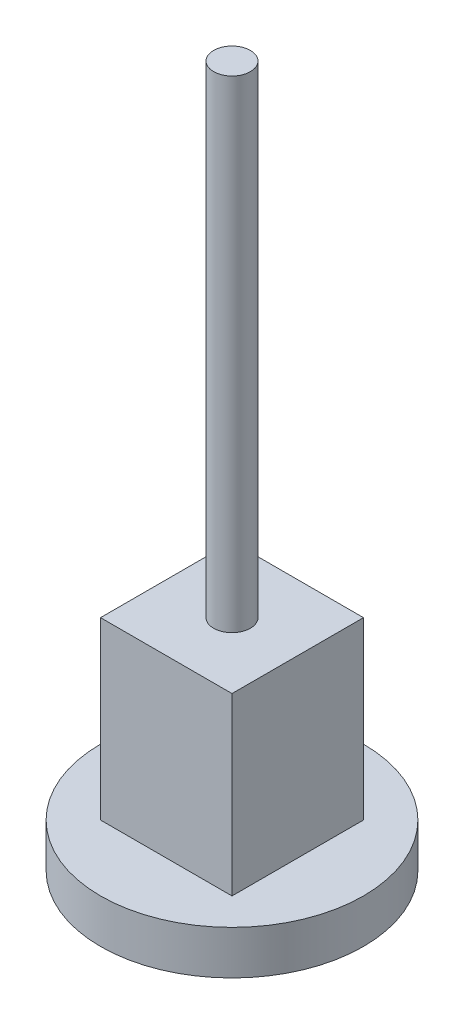
ISO-10303-21;
HEADER;
FILE_DESCRIPTION(('STEP AP214'),'2;1');
FILE_NAME('part.step','',(''),(''),'','','');
FILE_SCHEMA(('AUTOMOTIVE_DESIGN { 1 0 10303 214 1 1 1 1 }'));
ENDSEC;
DATA;
#1=APPLICATION_CONTEXT('core data for automotive mechanical design processes');
#2=APPLICATION_PROTOCOL_DEFINITION('international standard','automotive_design',2000,#1);
#3=PRODUCT_CONTEXT('',#1,'mechanical');
#4=PRODUCT('Part','Part','',(#3));
#5=PRODUCT_RELATED_PRODUCT_CATEGORY('part','',(#4));
#6=PRODUCT_DEFINITION_FORMATION('','',#4);
#7=PRODUCT_DEFINITION_CONTEXT('part definition',#1,'design');
#8=PRODUCT_DEFINITION('design','',#6,#7);
#9=PRODUCT_DEFINITION_SHAPE('','',#8);
#10=(LENGTH_UNIT() NAMED_UNIT(*) SI_UNIT(.MILLI.,.METRE.));
#11=(NAMED_UNIT(*) PLANE_ANGLE_UNIT() SI_UNIT($,.RADIAN.));
#12=(NAMED_UNIT(*) SI_UNIT($,.STERADIAN.) SOLID_ANGLE_UNIT());
#13=UNCERTAINTY_MEASURE_WITH_UNIT(LENGTH_MEASURE(1.E-05),#10,'distance_accuracy_value','');
#14=(GEOMETRIC_REPRESENTATION_CONTEXT(3) GLOBAL_UNCERTAINTY_ASSIGNED_CONTEXT((#13)) GLOBAL_UNIT_ASSIGNED_CONTEXT((#10,
#11,#12)) REPRESENTATION_CONTEXT('',''));
#15=CARTESIAN_POINT('',(0.,0.,0.));
#16=DIRECTION('',(0.,0.,1.));
#17=DIRECTION('',(1.,0.,0.));
#18=AXIS2_PLACEMENT_3D('',#15,#16,#17);
#19=CARTESIAN_POINT('',(0.,10.,0.));
#20=DIRECTION('',(0.,1.,0.));
#21=DIRECTION('',(0.,0.,1.));
#22=AXIS2_PLACEMENT_3D('',#19,#20,#21);
#23=PLANE('',#22);
#24=CARTESIAN_POINT('',(0.,10.,0.));
#25=DIRECTION('',(0.,1.,0.));
#26=DIRECTION('',(0.,0.,1.));
#27=AXIS2_PLACEMENT_3D('',#24,#25,#26);
#28=CIRCLE('',#27,30.);
#29=CARTESIAN_POINT('',(0.,10.,30.));
#30=VERTEX_POINT('',#29);
#31=EDGE_CURVE('E11',#30,#30,#28,.T.);
#32=ORIENTED_EDGE('',*,*,#31,.T.);
#33=EDGE_LOOP('',(#32));
#34=FACE_BOUND('',#33,.T.);
#35=DIRECTION('',(-1.,0.,0.));
#36=VECTOR('',#35,1.);
#37=CARTESIAN_POINT('',(-15.,10.,-15.));
#38=LINE('',#37,#36);
#39=CARTESIAN_POINT('',(15.,10.,-15.));
#40=VERTEX_POINT('',#39);
#41=CARTESIAN_POINT('',(-15.,10.,-15.));
#42=VERTEX_POINT('',#41);
#43=EDGE_CURVE('E89',#40,#42,#38,.T.);
#44=ORIENTED_EDGE('',*,*,#43,.F.);
#45=DIRECTION('',(0.,0.,-1.));
#46=VECTOR('',#45,1.);
#47=CARTESIAN_POINT('',(15.,10.,-15.));
#48=LINE('',#47,#46);
#49=CARTESIAN_POINT('',(15.,10.,15.));
#50=VERTEX_POINT('',#49);
#51=EDGE_CURVE('E100',#50,#40,#48,.T.);
#52=ORIENTED_EDGE('',*,*,#51,.F.);
#53=DIRECTION('',(1.,0.,0.));
#54=VECTOR('',#53,1.);
#55=CARTESIAN_POINT('',(-15.,10.,15.));
#56=LINE('',#55,#54);
#57=CARTESIAN_POINT('',(-15.,10.,15.));
#58=VERTEX_POINT('',#57);
#59=EDGE_CURVE('E70',#58,#50,#56,.T.);
#60=ORIENTED_EDGE('',*,*,#59,.F.);
#61=DIRECTION('',(0.,0.,1.));
#62=VECTOR('',#61,1.);
#63=CARTESIAN_POINT('',(-15.,10.,-15.));
#64=LINE('',#63,#62);
#65=EDGE_CURVE('E105',#42,#58,#64,.T.);
#66=ORIENTED_EDGE('',*,*,#65,.F.);
#67=EDGE_LOOP('',(#44,#52,#60,#66));
#68=FACE_BOUND('',#67,.T.);
#69=ADVANCED_FACE('F33',(#34,#68),#23,.T.);
#70=CARTESIAN_POINT('',(0.,10.,0.));
#71=DIRECTION('',(0.,-1.,0.));
#72=DIRECTION('',(0.,0.,-1.));
#73=AXIS2_PLACEMENT_3D('',#70,#71,#72);
#74=CYLINDRICAL_SURFACE('',#73,30.);
#75=ORIENTED_EDGE('',*,*,#31,.F.);
#76=EDGE_LOOP('',(#75));
#77=FACE_BOUND('',#76,.T.);
#78=CARTESIAN_POINT('',(0.,0.,0.));
#79=DIRECTION('',(0.,1.,0.));
#80=DIRECTION('',(0.,0.,1.));
#81=AXIS2_PLACEMENT_3D('',#78,#79,#80);
#82=CIRCLE('',#81,30.);
#83=CARTESIAN_POINT('',(0.,0.,30.));
#84=VERTEX_POINT('',#83);
#85=EDGE_CURVE('E37',#84,#84,#82,.T.);
#86=ORIENTED_EDGE('',*,*,#85,.T.);
#87=EDGE_LOOP('',(#86));
#88=FACE_BOUND('',#87,.T.);
#89=ADVANCED_FACE('F35',(#77,#88),#74,.T.);
#90=CARTESIAN_POINT('',(0.,0.,0.));
#91=DIRECTION('',(0.,1.,0.));
#92=DIRECTION('',(0.,0.,1.));
#93=AXIS2_PLACEMENT_3D('',#90,#91,#92);
#94=PLANE('',#93);
#95=ORIENTED_EDGE('',*,*,#85,.F.);
#96=EDGE_LOOP('',(#95));
#97=FACE_BOUND('',#96,.T.);
#98=ADVANCED_FACE('F114',(#97),#94,.F.);
#99=CARTESIAN_POINT('',(15.,50.,-15.));
#100=DIRECTION('',(-1.,0.,0.));
#101=DIRECTION('',(0.,0.,1.));
#102=AXIS2_PLACEMENT_3D('',#99,#100,#101);
#103=PLANE('',#102);
#104=ORIENTED_EDGE('',*,*,#51,.T.);
#105=DIRECTION('',(0.,-1.,0.));
#106=VECTOR('',#105,1.);
#107=CARTESIAN_POINT('',(15.,50.,-15.));
#108=LINE('',#107,#106);
#109=CARTESIAN_POINT('',(15.,50.,-15.));
#110=VERTEX_POINT('',#109);
#111=EDGE_CURVE('E92',#110,#40,#108,.T.);
#112=ORIENTED_EDGE('',*,*,#111,.F.);
#113=DIRECTION('',(0.,0.,-1.));
#114=VECTOR('',#113,1.);
#115=CARTESIAN_POINT('',(15.,50.,-15.));
#116=LINE('',#115,#114);
#117=CARTESIAN_POINT('',(15.,50.,15.));
#118=VERTEX_POINT('',#117);
#119=EDGE_CURVE('E82',#118,#110,#116,.T.);
#120=ORIENTED_EDGE('',*,*,#119,.F.);
#121=DIRECTION('',(0.,-1.,0.));
#122=VECTOR('',#121,1.);
#123=CARTESIAN_POINT('',(15.,50.,15.));
#124=LINE('',#123,#122);
#125=EDGE_CURVE('E96',#118,#50,#124,.T.);
#126=ORIENTED_EDGE('',*,*,#125,.T.);
#127=EDGE_LOOP('',(#104,#112,#120,#126));
#128=FACE_BOUND('',#127,.T.);
#129=ADVANCED_FACE('F116',(#128),#103,.F.);
#130=CARTESIAN_POINT('',(-15.,50.,-15.));
#131=DIRECTION('',(0.,0.,1.));
#132=DIRECTION('',(1.,0.,0.));
#133=AXIS2_PLACEMENT_3D('',#130,#131,#132);
#134=PLANE('',#133);
#135=ORIENTED_EDGE('',*,*,#43,.T.);
#136=DIRECTION('',(0.,-1.,0.));
#137=VECTOR('',#136,1.);
#138=CARTESIAN_POINT('',(-15.,50.,-15.));
#139=LINE('',#138,#137);
#140=CARTESIAN_POINT('',(-15.,50.,-15.));
#141=VERTEX_POINT('',#140);
#142=EDGE_CURVE('E86',#141,#42,#139,.T.);
#143=ORIENTED_EDGE('',*,*,#142,.F.);
#144=DIRECTION('',(-1.,0.,0.));
#145=VECTOR('',#144,1.);
#146=CARTESIAN_POINT('',(-15.,50.,-15.));
#147=LINE('',#146,#145);
#148=EDGE_CURVE('E77',#110,#141,#147,.T.);
#149=ORIENTED_EDGE('',*,*,#148,.F.);
#150=ORIENTED_EDGE('',*,*,#111,.T.);
#151=EDGE_LOOP('',(#135,#143,#149,#150));
#152=FACE_BOUND('',#151,.T.);
#153=ADVANCED_FACE('F87',(#152),#134,.F.);
#154=CARTESIAN_POINT('',(-15.,50.,-15.));
#155=DIRECTION('',(1.,0.,0.));
#156=DIRECTION('',(0.,0.,-1.));
#157=AXIS2_PLACEMENT_3D('',#154,#155,#156);
#158=PLANE('',#157);
#159=ORIENTED_EDGE('',*,*,#65,.T.);
#160=DIRECTION('',(0.,-1.,0.));
#161=VECTOR('',#160,1.);
#162=CARTESIAN_POINT('',(-15.,50.,15.));
#163=LINE('',#162,#161);
#164=CARTESIAN_POINT('',(-15.,50.,15.));
#165=VERTEX_POINT('',#164);
#166=EDGE_CURVE('E48',#165,#58,#163,.T.);
#167=ORIENTED_EDGE('',*,*,#166,.F.);
#168=DIRECTION('',(0.,0.,1.));
#169=VECTOR('',#168,1.);
#170=CARTESIAN_POINT('',(-15.,50.,-15.));
#171=LINE('',#170,#169);
#172=EDGE_CURVE('E80',#141,#165,#171,.T.);
#173=ORIENTED_EDGE('',*,*,#172,.F.);
#174=ORIENTED_EDGE('',*,*,#142,.T.);
#175=EDGE_LOOP('',(#159,#167,#173,#174));
#176=FACE_BOUND('',#175,.T.);
#177=ADVANCED_FACE('F94',(#176),#158,.F.);
#178=CARTESIAN_POINT('',(-15.,50.,15.));
#179=DIRECTION('',(0.,0.,-1.));
#180=DIRECTION('',(-1.,0.,0.));
#181=AXIS2_PLACEMENT_3D('',#178,#179,#180);
#182=PLANE('',#181);
#183=ORIENTED_EDGE('',*,*,#59,.T.);
#184=ORIENTED_EDGE('',*,*,#125,.F.);
#185=DIRECTION('',(1.,0.,0.));
#186=VECTOR('',#185,1.);
#187=CARTESIAN_POINT('',(-15.,50.,15.));
#188=LINE('',#187,#186);
#189=EDGE_CURVE('E56',#165,#118,#188,.T.);
#190=ORIENTED_EDGE('',*,*,#189,.F.);
#191=ORIENTED_EDGE('',*,*,#166,.T.);
#192=EDGE_LOOP('',(#183,#184,#190,#191));
#193=FACE_BOUND('',#192,.T.);
#194=ADVANCED_FACE('F135',(#193),#182,.F.);
#195=CARTESIAN_POINT('',(0.,50.,0.));
#196=DIRECTION('',(0.,1.,0.));
#197=DIRECTION('',(0.,0.,1.));
#198=AXIS2_PLACEMENT_3D('',#195,#196,#197);
#199=PLANE('',#198);
#200=CARTESIAN_POINT('',(0.,50.,0.));
#201=DIRECTION('',(0.,1.,0.));
#202=DIRECTION('',(0.,0.,1.));
#203=AXIS2_PLACEMENT_3D('',#200,#201,#202);
#204=CIRCLE('',#203,4.19696706571844);
#205=CARTESIAN_POINT('',(0.,50.,4.19696706571844));
#206=VERTEX_POINT('',#205);
#207=EDGE_CURVE('E152',#206,#206,#204,.T.);
#208=ORIENTED_EDGE('',*,*,#207,.F.);
#209=EDGE_LOOP('',(#208));
#210=FACE_BOUND('',#209,.T.);
#211=ORIENTED_EDGE('',*,*,#119,.T.);
#212=ORIENTED_EDGE('',*,*,#148,.T.);
#213=ORIENTED_EDGE('',*,*,#172,.T.);
#214=ORIENTED_EDGE('',*,*,#189,.T.);
#215=EDGE_LOOP('',(#211,#212,#213,#214));
#216=FACE_BOUND('',#215,.T.);
#217=ADVANCED_FACE('F78',(#210,#216),#199,.T.);
#218=CARTESIAN_POINT('',(0.,160.,0.));
#219=DIRECTION('',(0.,-1.,0.));
#220=DIRECTION('',(0.,0.,-1.));
#221=AXIS2_PLACEMENT_3D('',#218,#219,#220);
#222=CYLINDRICAL_SURFACE('',#221,4.19696706571844);
#223=CARTESIAN_POINT('',(0.,160.,0.));
#224=DIRECTION('',(0.,1.,0.));
#225=DIRECTION('',(0.,0.,1.));
#226=AXIS2_PLACEMENT_3D('',#223,#224,#225);
#227=CIRCLE('',#226,4.19696706571844);
#228=CARTESIAN_POINT('',(0.,160.,4.19696706571844));
#229=VERTEX_POINT('',#228);
#230=EDGE_CURVE('E103',#229,#229,#227,.T.);
#231=ORIENTED_EDGE('',*,*,#230,.F.);
#232=EDGE_LOOP('',(#231));
#233=FACE_BOUND('',#232,.T.);
#234=ORIENTED_EDGE('',*,*,#207,.T.);
#235=EDGE_LOOP('',(#234));
#236=FACE_BOUND('',#235,.T.);
#237=ADVANCED_FACE('F140',(#233,#236),#222,.T.);
#238=CARTESIAN_POINT('',(0.,160.,0.));
#239=DIRECTION('',(0.,1.,0.));
#240=DIRECTION('',(0.,0.,1.));
#241=AXIS2_PLACEMENT_3D('',#238,#239,#240);
#242=PLANE('',#241);
#243=ORIENTED_EDGE('',*,*,#230,.T.);
#244=EDGE_LOOP('',(#243));
#245=FACE_BOUND('',#244,.T.);
#246=ADVANCED_FACE('F144',(#245),#242,.T.);
#247=CLOSED_SHELL('',(#69,#89,#98,#129,#153,#177,#194,#217,#237,#246));
#248=MANIFOLD_SOLID_BREP('B2',#247);
#249=ADVANCED_BREP_SHAPE_REPRESENTATION('',(#18,#248),#14);
#250=SHAPE_DEFINITION_REPRESENTATION(#9,#249);
ENDSEC;
END-ISO-10303-21;
